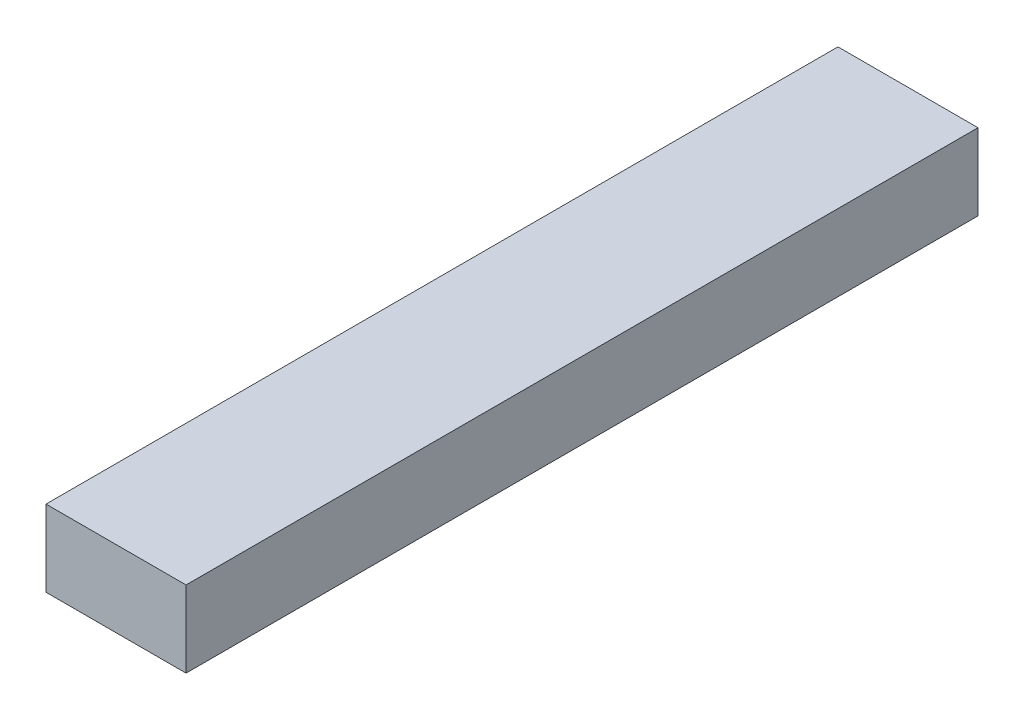
ISO-10303-21;
HEADER;
FILE_DESCRIPTION(('STEP AP214'),'2;1');
FILE_NAME('part.step','',(''),(''),'','','');
FILE_SCHEMA(('AUTOMOTIVE_DESIGN { 1 0 10303 214 1 1 1 1 }'));
ENDSEC;
DATA;
#1=APPLICATION_CONTEXT('core data for automotive mechanical design processes');
#2=APPLICATION_PROTOCOL_DEFINITION('international standard','automotive_design',2000,#1);
#3=PRODUCT_CONTEXT('',#1,'mechanical');
#4=PRODUCT('Part','Part','',(#3));
#5=PRODUCT_RELATED_PRODUCT_CATEGORY('part','',(#4));
#6=PRODUCT_DEFINITION_FORMATION('','',#4);
#7=PRODUCT_DEFINITION_CONTEXT('part definition',#1,'design');
#8=PRODUCT_DEFINITION('design','',#6,#7);
#9=PRODUCT_DEFINITION_SHAPE('','',#8);
#10=(LENGTH_UNIT() NAMED_UNIT(*) SI_UNIT(.MILLI.,.METRE.));
#11=(NAMED_UNIT(*) PLANE_ANGLE_UNIT() SI_UNIT($,.RADIAN.));
#12=(NAMED_UNIT(*) SI_UNIT($,.STERADIAN.) SOLID_ANGLE_UNIT());
#13=UNCERTAINTY_MEASURE_WITH_UNIT(LENGTH_MEASURE(1.E-05),#10,'distance_accuracy_value','');
#14=(GEOMETRIC_REPRESENTATION_CONTEXT(3) GLOBAL_UNCERTAINTY_ASSIGNED_CONTEXT((#13)) GLOBAL_UNIT_ASSIGNED_CONTEXT((#10,
#11,#12)) REPRESENTATION_CONTEXT('',''));
#15=CARTESIAN_POINT('',(0.,0.,0.));
#16=DIRECTION('',(0.,0.,1.));
#17=DIRECTION('',(1.,0.,0.));
#18=AXIS2_PLACEMENT_3D('',#15,#16,#17);
#19=CARTESIAN_POINT('',(0.,30.,0.));
#20=DIRECTION('',(1.,0.,0.));
#21=DIRECTION('',(0.,0.,-1.));
#22=AXIS2_PLACEMENT_3D('',#19,#20,#21);
#23=PLANE('',#22);
#24=DIRECTION('',(0.,0.,1.));
#25=VECTOR('',#24,1.);
#26=CARTESIAN_POINT('',(0.,0.,0.));
#27=LINE('',#26,#25);
#28=CARTESIAN_POINT('',(0.,0.,-311.));
#29=VERTEX_POINT('',#28);
#30=CARTESIAN_POINT('',(0.,0.,0.));
#31=VERTEX_POINT('',#30);
#32=EDGE_CURVE('E95',#29,#31,#27,.T.);
#33=ORIENTED_EDGE('',*,*,#32,.T.);
#34=DIRECTION('',(0.,-1.,0.));
#35=VECTOR('',#34,1.);
#36=CARTESIAN_POINT('',(0.,30.,0.));
#37=LINE('',#36,#35);
#38=CARTESIAN_POINT('',(0.,30.,0.));
#39=VERTEX_POINT('',#38);
#40=EDGE_CURVE('E11',#39,#31,#37,.T.);
#41=ORIENTED_EDGE('',*,*,#40,.F.);
#42=DIRECTION('',(0.,0.,1.));
#43=VECTOR('',#42,1.);
#44=CARTESIAN_POINT('',(0.,30.,0.));
#45=LINE('',#44,#43);
#46=CARTESIAN_POINT('',(0.,30.,-311.));
#47=VERTEX_POINT('',#46);
#48=EDGE_CURVE('E83',#47,#39,#45,.T.);
#49=ORIENTED_EDGE('',*,*,#48,.F.);
#50=DIRECTION('',(0.,-1.,0.));
#51=VECTOR('',#50,1.);
#52=CARTESIAN_POINT('',(0.,30.,-311.));
#53=LINE('',#52,#51);
#54=EDGE_CURVE('E91',#47,#29,#53,.T.);
#55=ORIENTED_EDGE('',*,*,#54,.T.);
#56=EDGE_LOOP('',(#33,#41,#49,#55));
#57=FACE_BOUND('',#56,.T.);
#58=ADVANCED_FACE('F32',(#57),#23,.F.);
#59=CARTESIAN_POINT('',(0.,30.,0.));
#60=DIRECTION('',(0.,0.,-1.));
#61=DIRECTION('',(-1.,0.,0.));
#62=AXIS2_PLACEMENT_3D('',#59,#60,#61);
#63=PLANE('',#62);
#64=DIRECTION('',(1.,0.,0.));
#65=VECTOR('',#64,1.);
#66=CARTESIAN_POINT('',(0.,0.,0.));
#67=LINE('',#66,#65);
#68=CARTESIAN_POINT('',(54.9999999999999,0.,0.));
#69=VERTEX_POINT('',#68);
#70=EDGE_CURVE('E87',#31,#69,#67,.T.);
#71=ORIENTED_EDGE('',*,*,#70,.T.);
#72=DIRECTION('',(0.,-1.,0.));
#73=VECTOR('',#72,1.);
#74=CARTESIAN_POINT('',(54.9999999999999,30.,0.));
#75=LINE('',#74,#73);
#76=CARTESIAN_POINT('',(54.9999999999999,30.,0.));
#77=VERTEX_POINT('',#76);
#78=EDGE_CURVE('E40',#77,#69,#75,.T.);
#79=ORIENTED_EDGE('',*,*,#78,.F.);
#80=DIRECTION('',(1.,0.,0.));
#81=VECTOR('',#80,1.);
#82=CARTESIAN_POINT('',(0.,30.,0.));
#83=LINE('',#82,#81);
#84=EDGE_CURVE('E78',#39,#77,#83,.T.);
#85=ORIENTED_EDGE('',*,*,#84,.F.);
#86=ORIENTED_EDGE('',*,*,#40,.T.);
#87=EDGE_LOOP('',(#71,#79,#85,#86));
#88=FACE_BOUND('',#87,.T.);
#89=ADVANCED_FACE('F86',(#88),#63,.F.);
#90=CARTESIAN_POINT('',(54.9999999999999,30.,0.));
#91=DIRECTION('',(-1.,0.,0.));
#92=DIRECTION('',(0.,0.,1.));
#93=AXIS2_PLACEMENT_3D('',#90,#91,#92);
#94=PLANE('',#93);
#95=DIRECTION('',(0.,0.,-1.));
#96=VECTOR('',#95,1.);
#97=CARTESIAN_POINT('',(54.9999999999999,0.,0.));
#98=LINE('',#97,#96);
#99=CARTESIAN_POINT('',(54.9999999999999,0.,-311.));
#100=VERTEX_POINT('',#99);
#101=EDGE_CURVE('E65',#69,#100,#98,.T.);
#102=ORIENTED_EDGE('',*,*,#101,.T.);
#103=DIRECTION('',(0.,-1.,0.));
#104=VECTOR('',#103,1.);
#105=CARTESIAN_POINT('',(54.9999999999999,30.,-311.));
#106=LINE('',#105,#104);
#107=CARTESIAN_POINT('',(54.9999999999999,30.,-311.));
#108=VERTEX_POINT('',#107);
#109=EDGE_CURVE('E88',#108,#100,#106,.T.);
#110=ORIENTED_EDGE('',*,*,#109,.F.);
#111=DIRECTION('',(0.,0.,-1.));
#112=VECTOR('',#111,1.);
#113=CARTESIAN_POINT('',(54.9999999999999,30.,0.));
#114=LINE('',#113,#112);
#115=EDGE_CURVE('E81',#77,#108,#114,.T.);
#116=ORIENTED_EDGE('',*,*,#115,.F.);
#117=ORIENTED_EDGE('',*,*,#78,.T.);
#118=EDGE_LOOP('',(#102,#110,#116,#117));
#119=FACE_BOUND('',#118,.T.);
#120=ADVANCED_FACE('F89',(#119),#94,.F.);
#121=CARTESIAN_POINT('',(0.,30.,-311.));
#122=DIRECTION('',(0.,0.,1.));
#123=DIRECTION('',(1.,0.,0.));
#124=AXIS2_PLACEMENT_3D('',#121,#122,#123);
#125=PLANE('',#124);
#126=DIRECTION('',(-1.,0.,0.));
#127=VECTOR('',#126,1.);
#128=CARTESIAN_POINT('',(0.,0.,-311.));
#129=LINE('',#128,#127);
#130=EDGE_CURVE('E71',#100,#29,#129,.T.);
#131=ORIENTED_EDGE('',*,*,#130,.T.);
#132=ORIENTED_EDGE('',*,*,#54,.F.);
#133=DIRECTION('',(-1.,0.,0.));
#134=VECTOR('',#133,1.);
#135=CARTESIAN_POINT('',(0.,30.,-311.));
#136=LINE('',#135,#134);
#137=EDGE_CURVE('E48',#108,#47,#136,.T.);
#138=ORIENTED_EDGE('',*,*,#137,.F.);
#139=ORIENTED_EDGE('',*,*,#109,.T.);
#140=EDGE_LOOP('',(#131,#132,#138,#139));
#141=FACE_BOUND('',#140,.T.);
#142=ADVANCED_FACE('F102',(#141),#125,.F.);
#143=CARTESIAN_POINT('',(0.,30.,0.));
#144=DIRECTION('',(0.,-1.,0.));
#145=DIRECTION('',(0.,0.,-1.));
#146=AXIS2_PLACEMENT_3D('',#143,#144,#145);
#147=PLANE('',#146);
#148=ORIENTED_EDGE('',*,*,#48,.T.);
#149=ORIENTED_EDGE('',*,*,#84,.T.);
#150=ORIENTED_EDGE('',*,*,#115,.T.);
#151=ORIENTED_EDGE('',*,*,#137,.T.);
#152=EDGE_LOOP('',(#148,#149,#150,#151));
#153=FACE_BOUND('',#152,.T.);
#154=ADVANCED_FACE('F79',(#153),#147,.F.);
#155=CARTESIAN_POINT('',(0.,0.,0.));
#156=DIRECTION('',(0.,-1.,0.));
#157=DIRECTION('',(0.,0.,-1.));
#158=AXIS2_PLACEMENT_3D('',#155,#156,#157);
#159=PLANE('',#158);
#160=ORIENTED_EDGE('',*,*,#32,.F.);
#161=ORIENTED_EDGE('',*,*,#130,.F.);
#162=ORIENTED_EDGE('',*,*,#101,.F.);
#163=ORIENTED_EDGE('',*,*,#70,.F.);
#164=EDGE_LOOP('',(#160,#161,#162,#163));
#165=FACE_BOUND('',#164,.T.);
#166=ADVANCED_FACE('F105',(#165),#159,.T.);
#167=CLOSED_SHELL('',(#58,#89,#120,#142,#154,#166));
#168=MANIFOLD_SOLID_BREP('B2',#167);
#169=ADVANCED_BREP_SHAPE_REPRESENTATION('',(#18,#168),#14);
#170=SHAPE_DEFINITION_REPRESENTATION(#9,#169);
ENDSEC;
END-ISO-10303-21;
